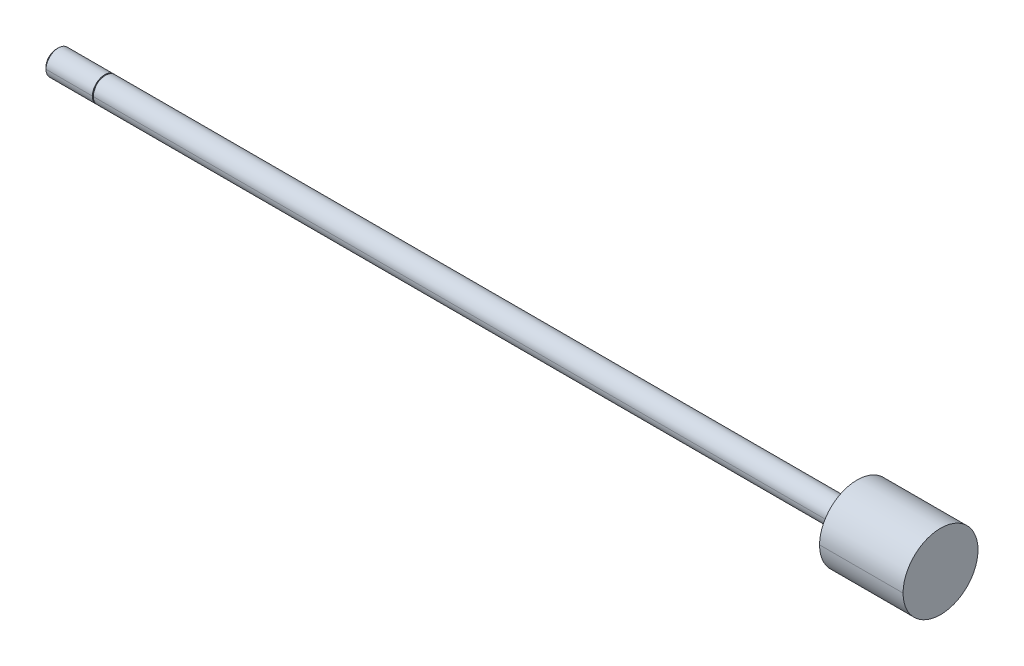
ISO-10303-21;
HEADER;
FILE_DESCRIPTION(('STEP AP214'),'2;1');
FILE_NAME('part.step','',(''),(''),'','','');
FILE_SCHEMA(('AUTOMOTIVE_DESIGN { 1 0 10303 214 1 1 1 1 }'));
ENDSEC;
DATA;
#1=APPLICATION_CONTEXT('core data for automotive mechanical design processes');
#2=APPLICATION_PROTOCOL_DEFINITION('international standard','automotive_design',2000,#1);
#3=PRODUCT_CONTEXT('',#1,'mechanical');
#4=PRODUCT('Part','Part','',(#3));
#5=PRODUCT_RELATED_PRODUCT_CATEGORY('part','',(#4));
#6=PRODUCT_DEFINITION_FORMATION('','',#4);
#7=PRODUCT_DEFINITION_CONTEXT('part definition',#1,'design');
#8=PRODUCT_DEFINITION('design','',#6,#7);
#9=PRODUCT_DEFINITION_SHAPE('','',#8);
#10=(LENGTH_UNIT() NAMED_UNIT(*) SI_UNIT(.MILLI.,.METRE.));
#11=(NAMED_UNIT(*) PLANE_ANGLE_UNIT() SI_UNIT($,.RADIAN.));
#12=(NAMED_UNIT(*) SI_UNIT($,.STERADIAN.) SOLID_ANGLE_UNIT());
#13=UNCERTAINTY_MEASURE_WITH_UNIT(LENGTH_MEASURE(1.E-05),#10,'distance_accuracy_value','');
#14=(GEOMETRIC_REPRESENTATION_CONTEXT(3) GLOBAL_UNCERTAINTY_ASSIGNED_CONTEXT((#13)) GLOBAL_UNIT_ASSIGNED_CONTEXT((#10,
#11,#12)) REPRESENTATION_CONTEXT('',''));
#15=CARTESIAN_POINT('',(0.,0.,0.));
#16=DIRECTION('',(0.,0.,1.));
#17=DIRECTION('',(1.,0.,0.));
#18=AXIS2_PLACEMENT_3D('',#15,#16,#17);
#19=CARTESIAN_POINT('',(0.,0.,0.));
#20=DIRECTION('',(-1.,0.,0.));
#21=DIRECTION('',(0.,-1.,0.));
#22=AXIS2_PLACEMENT_3D('',#19,#20,#21);
#23=CYLINDRICAL_SURFACE('',#22,2.921);
#24=CARTESIAN_POINT('',(0.,0.,0.));
#25=DIRECTION('',(1.,0.,0.));
#26=DIRECTION('',(0.,0.,-1.));
#27=AXIS2_PLACEMENT_3D('',#24,#25,#26);
#28=CIRCLE('',#27,2.921);
#29=CARTESIAN_POINT('',(0.,0.,-2.921));
#30=VERTEX_POINT('',#29);
#31=CARTESIAN_POINT('',(0.,0.,2.921));
#32=VERTEX_POINT('',#31);
#33=EDGE_CURVE('E11',#30,#32,#28,.T.);
#34=ORIENTED_EDGE('',*,*,#33,.F.);
#35=DIRECTION('',(-1.,0.,0.));
#36=VECTOR('',#35,1.);
#37=CARTESIAN_POINT('',(0.,0.,-2.921));
#38=LINE('',#37,#36);
#39=CARTESIAN_POINT('',(-0.254,0.,-2.921));
#40=VERTEX_POINT('',#39);
#41=EDGE_CURVE('E25',#30,#40,#38,.T.);
#42=ORIENTED_EDGE('',*,*,#41,.T.);
#43=CARTESIAN_POINT('',(-0.254,0.,0.));
#44=DIRECTION('',(1.,0.,0.));
#45=DIRECTION('',(0.,0.,-1.));
#46=AXIS2_PLACEMENT_3D('',#43,#44,#45);
#47=CIRCLE('',#46,2.921);
#48=CARTESIAN_POINT('',(-0.254,0.,2.921));
#49=VERTEX_POINT('',#48);
#50=EDGE_CURVE('E211',#40,#49,#47,.T.);
#51=ORIENTED_EDGE('',*,*,#50,.T.);
#52=DIRECTION('',(-1.,0.,0.));
#53=VECTOR('',#52,1.);
#54=CARTESIAN_POINT('',(0.,0.,2.921));
#55=LINE('',#54,#53);
#56=EDGE_CURVE('E206',#32,#49,#55,.T.);
#57=ORIENTED_EDGE('',*,*,#56,.F.);
#58=EDGE_LOOP('',(#34,#42,#51,#57));
#59=FACE_BOUND('',#58,.T.);
#60=ADVANCED_FACE('F17',(#59),#23,.T.);
#61=CARTESIAN_POINT('',(0.,0.,0.));
#62=DIRECTION('',(-1.,0.,0.));
#63=DIRECTION('',(0.,1.,0.));
#64=AXIS2_PLACEMENT_3D('',#61,#62,#63);
#65=CYLINDRICAL_SURFACE('',#64,2.921);
#66=CARTESIAN_POINT('',(-0.254,0.,0.));
#67=DIRECTION('',(1.,0.,0.));
#68=DIRECTION('',(0.,0.,-1.));
#69=AXIS2_PLACEMENT_3D('',#66,#67,#68);
#70=CIRCLE('',#69,2.921);
#71=EDGE_CURVE('E202',#49,#40,#70,.T.);
#72=ORIENTED_EDGE('',*,*,#71,.T.);
#73=ORIENTED_EDGE('',*,*,#41,.F.);
#74=CARTESIAN_POINT('',(0.,0.,0.));
#75=DIRECTION('',(1.,0.,0.));
#76=DIRECTION('',(0.,0.,-1.));
#77=AXIS2_PLACEMENT_3D('',#74,#75,#76);
#78=CIRCLE('',#77,2.921);
#79=EDGE_CURVE('E197',#32,#30,#78,.T.);
#80=ORIENTED_EDGE('',*,*,#79,.F.);
#81=ORIENTED_EDGE('',*,*,#56,.T.);
#82=EDGE_LOOP('',(#72,#73,#80,#81));
#83=FACE_BOUND('',#82,.T.);
#84=ADVANCED_FACE('F224',(#83),#65,.T.);
#85=CARTESIAN_POINT('',(0.,2.921,0.));
#86=DIRECTION('',(1.,0.,0.));
#87=DIRECTION('',(0.,0.,-1.));
#88=AXIS2_PLACEMENT_3D('',#85,#86,#87);
#89=PLANE('',#88);
#90=CARTESIAN_POINT('',(0.,0.,0.));
#91=DIRECTION('',(1.,0.,0.));
#92=DIRECTION('',(0.,0.,-1.));
#93=AXIS2_PLACEMENT_3D('',#90,#91,#92);
#94=CIRCLE('',#93,3.175);
#95=CARTESIAN_POINT('',(0.,0.,-3.175));
#96=VERTEX_POINT('',#95);
#97=CARTESIAN_POINT('',(0.,0.,3.175));
#98=VERTEX_POINT('',#97);
#99=EDGE_CURVE('E192',#96,#98,#94,.T.);
#100=ORIENTED_EDGE('',*,*,#99,.F.);
#101=CARTESIAN_POINT('',(0.,0.,0.));
#102=DIRECTION('',(1.,0.,0.));
#103=DIRECTION('',(0.,0.,-1.));
#104=AXIS2_PLACEMENT_3D('',#101,#102,#103);
#105=CIRCLE('',#104,3.175);
#106=EDGE_CURVE('E187',#98,#96,#105,.T.);
#107=ORIENTED_EDGE('',*,*,#106,.F.);
#108=EDGE_LOOP('',(#100,#107));
#109=FACE_BOUND('',#108,.T.);
#110=ORIENTED_EDGE('',*,*,#33,.T.);
#111=ORIENTED_EDGE('',*,*,#79,.T.);
#112=EDGE_LOOP('',(#110,#111));
#113=FACE_BOUND('',#112,.T.);
#114=ADVANCED_FACE('F249',(#109,#113),#89,.F.);
#115=CARTESIAN_POINT('',(214.3252,0.,0.));
#116=DIRECTION('',(-1.,0.,0.));
#117=DIRECTION('',(0.,1.,0.));
#118=AXIS2_PLACEMENT_3D('',#115,#116,#117);
#119=CYLINDRICAL_SURFACE('',#118,3.175);
#120=ORIENTED_EDGE('',*,*,#106,.T.);
#121=DIRECTION('',(-1.,0.,0.));
#122=VECTOR('',#121,1.);
#123=CARTESIAN_POINT('',(192.8876,0.,-3.175));
#124=LINE('',#123,#122);
#125=CARTESIAN_POINT('',(192.8876,0.,-3.175));
#126=VERTEX_POINT('',#125);
#127=EDGE_CURVE('E182',#126,#96,#124,.T.);
#128=ORIENTED_EDGE('',*,*,#127,.F.);
#129=CARTESIAN_POINT('',(192.8876,0.,0.));
#130=DIRECTION('',(1.,0.,0.));
#131=DIRECTION('',(0.,0.,-1.));
#132=AXIS2_PLACEMENT_3D('',#129,#130,#131);
#133=CIRCLE('',#132,3.175);
#134=CARTESIAN_POINT('',(192.8876,0.,3.175));
#135=VERTEX_POINT('',#134);
#136=EDGE_CURVE('E177',#135,#126,#133,.T.);
#137=ORIENTED_EDGE('',*,*,#136,.F.);
#138=DIRECTION('',(-1.,0.,0.));
#139=VECTOR('',#138,1.);
#140=CARTESIAN_POINT('',(192.8876,0.,3.175));
#141=LINE('',#140,#139);
#142=EDGE_CURVE('E172',#135,#98,#141,.T.);
#143=ORIENTED_EDGE('',*,*,#142,.T.);
#144=EDGE_LOOP('',(#120,#128,#137,#143));
#145=FACE_BOUND('',#144,.T.);
#146=ADVANCED_FACE('F253',(#145),#119,.T.);
#147=CARTESIAN_POINT('',(214.3252,0.,0.));
#148=DIRECTION('',(-1.,0.,0.));
#149=DIRECTION('',(0.,-1.,0.));
#150=AXIS2_PLACEMENT_3D('',#147,#148,#149);
#151=CYLINDRICAL_SURFACE('',#150,3.175);
#152=CARTESIAN_POINT('',(192.8876,0.,0.));
#153=DIRECTION('',(1.,0.,0.));
#154=DIRECTION('',(0.,0.,-1.));
#155=AXIS2_PLACEMENT_3D('',#152,#153,#154);
#156=CIRCLE('',#155,3.175);
#157=EDGE_CURVE('E167',#126,#135,#156,.T.);
#158=ORIENTED_EDGE('',*,*,#157,.F.);
#159=ORIENTED_EDGE('',*,*,#127,.T.);
#160=ORIENTED_EDGE('',*,*,#99,.T.);
#161=ORIENTED_EDGE('',*,*,#142,.F.);
#162=EDGE_LOOP('',(#158,#159,#160,#161));
#163=FACE_BOUND('',#162,.T.);
#164=ADVANCED_FACE('F259',(#163),#151,.T.);
#165=CARTESIAN_POINT('',(192.8876,3.175,0.));
#166=DIRECTION('',(1.,0.,0.));
#167=DIRECTION('',(0.,0.,-1.));
#168=AXIS2_PLACEMENT_3D('',#165,#166,#167);
#169=PLANE('',#168);
#170=CARTESIAN_POINT('',(192.8876,0.,0.));
#171=DIRECTION('',(1.,0.,0.));
#172=DIRECTION('',(0.,0.,-1.));
#173=AXIS2_PLACEMENT_3D('',#170,#171,#172);
#174=CIRCLE('',#173,9.62025);
#175=CARTESIAN_POINT('',(192.8876,0.,-9.62025));
#176=VERTEX_POINT('',#175);
#177=CARTESIAN_POINT('',(192.8876,0.,9.62025));
#178=VERTEX_POINT('',#177);
#179=EDGE_CURVE('E162',#176,#178,#174,.T.);
#180=ORIENTED_EDGE('',*,*,#179,.F.);
#181=CARTESIAN_POINT('',(192.8876,0.,0.));
#182=DIRECTION('',(1.,0.,0.));
#183=DIRECTION('',(0.,0.,-1.));
#184=AXIS2_PLACEMENT_3D('',#181,#182,#183);
#185=CIRCLE('',#184,9.62025);
#186=EDGE_CURVE('E157',#178,#176,#185,.T.);
#187=ORIENTED_EDGE('',*,*,#186,.F.);
#188=EDGE_LOOP('',(#180,#187));
#189=FACE_BOUND('',#188,.T.);
#190=ORIENTED_EDGE('',*,*,#157,.T.);
#191=ORIENTED_EDGE('',*,*,#136,.T.);
#192=EDGE_LOOP('',(#190,#191));
#193=FACE_BOUND('',#192,.T.);
#194=ADVANCED_FACE('F263',(#189,#193),#169,.F.);
#195=CARTESIAN_POINT('',(214.3252,0.,0.));
#196=DIRECTION('',(-1.,0.,0.));
#197=DIRECTION('',(0.,1.,0.));
#198=AXIS2_PLACEMENT_3D('',#195,#196,#197);
#199=CYLINDRICAL_SURFACE('',#198,9.62025);
#200=ORIENTED_EDGE('',*,*,#186,.T.);
#201=DIRECTION('',(-1.,0.,0.));
#202=VECTOR('',#201,1.);
#203=CARTESIAN_POINT('',(214.3252,0.,-9.62025));
#204=LINE('',#203,#202);
#205=CARTESIAN_POINT('',(214.3252,0.,-9.62025));
#206=VERTEX_POINT('',#205);
#207=EDGE_CURVE('E152',#206,#176,#204,.T.);
#208=ORIENTED_EDGE('',*,*,#207,.F.);
#209=CARTESIAN_POINT('',(214.3252,0.,0.));
#210=DIRECTION('',(1.,0.,0.));
#211=DIRECTION('',(0.,0.,-1.));
#212=AXIS2_PLACEMENT_3D('',#209,#210,#211);
#213=CIRCLE('',#212,9.62025);
#214=CARTESIAN_POINT('',(214.3252,0.,9.62025));
#215=VERTEX_POINT('',#214);
#216=EDGE_CURVE('E147',#215,#206,#213,.T.);
#217=ORIENTED_EDGE('',*,*,#216,.F.);
#218=DIRECTION('',(-1.,0.,0.));
#219=VECTOR('',#218,1.);
#220=CARTESIAN_POINT('',(214.3252,0.,9.62025));
#221=LINE('',#220,#219);
#222=EDGE_CURVE('E142',#215,#178,#221,.T.);
#223=ORIENTED_EDGE('',*,*,#222,.T.);
#224=EDGE_LOOP('',(#200,#208,#217,#223));
#225=FACE_BOUND('',#224,.T.);
#226=ADVANCED_FACE('F267',(#225),#199,.T.);
#227=CARTESIAN_POINT('',(214.3252,0.,0.));
#228=DIRECTION('',(-1.,0.,0.));
#229=DIRECTION('',(0.,-1.,0.));
#230=AXIS2_PLACEMENT_3D('',#227,#228,#229);
#231=CYLINDRICAL_SURFACE('',#230,9.62025);
#232=CARTESIAN_POINT('',(214.3252,0.,0.));
#233=DIRECTION('',(1.,0.,0.));
#234=DIRECTION('',(0.,0.,-1.));
#235=AXIS2_PLACEMENT_3D('',#232,#233,#234);
#236=CIRCLE('',#235,9.62025);
#237=EDGE_CURVE('E137',#206,#215,#236,.T.);
#238=ORIENTED_EDGE('',*,*,#237,.F.);
#239=ORIENTED_EDGE('',*,*,#207,.T.);
#240=ORIENTED_EDGE('',*,*,#179,.T.);
#241=ORIENTED_EDGE('',*,*,#222,.F.);
#242=EDGE_LOOP('',(#238,#239,#240,#241));
#243=FACE_BOUND('',#242,.T.);
#244=ADVANCED_FACE('F271',(#243),#231,.T.);
#245=CARTESIAN_POINT('',(214.3252,9.62025,0.));
#246=DIRECTION('',(-1.,0.,0.));
#247=DIRECTION('',(0.,0.,1.));
#248=AXIS2_PLACEMENT_3D('',#245,#246,#247);
#249=PLANE('',#248);
#250=ORIENTED_EDGE('',*,*,#237,.T.);
#251=ORIENTED_EDGE('',*,*,#216,.T.);
#252=EDGE_LOOP('',(#250,#251));
#253=FACE_BOUND('',#252,.T.);
#254=ADVANCED_FACE('F229',(#253),#249,.F.);
#255=CARTESIAN_POINT('',(-0.254,3.429,0.));
#256=DIRECTION('',(-1.,0.,0.));
#257=DIRECTION('',(0.,0.,1.));
#258=AXIS2_PLACEMENT_3D('',#255,#256,#257);
#259=PLANE('',#258);
#260=ORIENTED_EDGE('',*,*,#50,.F.);
#261=ORIENTED_EDGE('',*,*,#71,.F.);
#262=EDGE_LOOP('',(#260,#261));
#263=FACE_BOUND('',#262,.T.);
#264=CARTESIAN_POINT('',(-0.254000000000005,0.,0.));
#265=DIRECTION('',(-1.,0.,0.));
#266=DIRECTION('',(0.,0.,1.));
#267=AXIS2_PLACEMENT_3D('',#264,#265,#266);
#268=CIRCLE('',#267,3.175);
#269=CARTESIAN_POINT('',(-0.254000000000005,0.,3.175));
#270=VERTEX_POINT('',#269);
#271=CARTESIAN_POINT('',(-0.254000000000019,0.,-3.175));
#272=VERTEX_POINT('',#271);
#273=EDGE_CURVE('E132',#270,#272,#268,.T.);
#274=ORIENTED_EDGE('',*,*,#273,.F.);
#275=CARTESIAN_POINT('',(-0.254000000000005,0.,0.));
#276=DIRECTION('',(-1.,0.,0.));
#277=DIRECTION('',(0.,0.,1.));
#278=AXIS2_PLACEMENT_3D('',#275,#276,#277);
#279=CIRCLE('',#278,3.175);
#280=EDGE_CURVE('E127',#272,#270,#279,.T.);
#281=ORIENTED_EDGE('',*,*,#280,.F.);
#282=EDGE_LOOP('',(#274,#281));
#283=FACE_BOUND('',#282,.T.);
#284=ADVANCED_FACE('F225',(#263,#283),#259,.F.);
#285=CARTESIAN_POINT('',(214.3252,0.,0.));
#286=DIRECTION('',(-1.,0.,0.));
#287=DIRECTION('',(0.,1.,0.));
#288=AXIS2_PLACEMENT_3D('',#285,#286,#287);
#289=CYLINDRICAL_SURFACE('',#288,3.175);
#290=CARTESIAN_POINT('',(-12.15898,0.,0.));
#291=DIRECTION('',(1.,0.,0.));
#292=DIRECTION('',(0.,0.,-1.));
#293=AXIS2_PLACEMENT_3D('',#290,#291,#292);
#294=CIRCLE('',#293,3.175);
#295=CARTESIAN_POINT('',(-12.15898,0.,3.175));
#296=VERTEX_POINT('',#295);
#297=CARTESIAN_POINT('',(-12.15898,0.,-3.175));
#298=VERTEX_POINT('',#297);
#299=EDGE_CURVE('E98',#296,#298,#294,.T.);
#300=ORIENTED_EDGE('',*,*,#299,.T.);
#301=DIRECTION('',(-1.,0.,0.));
#302=VECTOR('',#301,1.);
#303=CARTESIAN_POINT('',(-0.254000000000019,0.,-3.175));
#304=LINE('',#303,#302);
#305=EDGE_CURVE('E119',#272,#298,#304,.T.);
#306=ORIENTED_EDGE('',*,*,#305,.F.);
#307=ORIENTED_EDGE('',*,*,#280,.T.);
#308=DIRECTION('',(-1.,0.,0.));
#309=VECTOR('',#308,1.);
#310=CARTESIAN_POINT('',(-0.254000000000019,0.,3.175));
#311=LINE('',#310,#309);
#312=EDGE_CURVE('E115',#270,#296,#311,.T.);
#313=ORIENTED_EDGE('',*,*,#312,.T.);
#314=EDGE_LOOP('',(#300,#306,#307,#313));
#315=FACE_BOUND('',#314,.T.);
#316=ADVANCED_FACE('F228',(#315),#289,.T.);
#317=CARTESIAN_POINT('',(214.3252,0.,0.));
#318=DIRECTION('',(-1.,0.,0.));
#319=DIRECTION('',(0.,-1.,0.));
#320=AXIS2_PLACEMENT_3D('',#317,#318,#319);
#321=CYLINDRICAL_SURFACE('',#320,3.175);
#322=ORIENTED_EDGE('',*,*,#273,.T.);
#323=ORIENTED_EDGE('',*,*,#305,.T.);
#324=CARTESIAN_POINT('',(-12.15898,0.,0.));
#325=DIRECTION('',(1.,0.,0.));
#326=DIRECTION('',(0.,0.,-1.));
#327=AXIS2_PLACEMENT_3D('',#324,#325,#326);
#328=CIRCLE('',#327,3.175);
#329=EDGE_CURVE('E110',#298,#296,#328,.T.);
#330=ORIENTED_EDGE('',*,*,#329,.T.);
#331=ORIENTED_EDGE('',*,*,#312,.F.);
#332=EDGE_LOOP('',(#322,#323,#330,#331));
#333=FACE_BOUND('',#332,.T.);
#334=ADVANCED_FACE('F235',(#333),#321,.T.);
#335=CARTESIAN_POINT('',(-12.7,0.,0.));
#336=DIRECTION('',(1.,0.,0.));
#337=DIRECTION('',(0.,-1.,0.));
#338=AXIS2_PLACEMENT_3D('',#335,#336,#337);
#339=CONICAL_SURFACE('',#338,2.63398,0.7853981634);
#340=ORIENTED_EDGE('',*,*,#329,.F.);
#341=DIRECTION('',(0.707106781184742,0.,-0.707106781188353));
#342=VECTOR('',#341,1.);
#343=CARTESIAN_POINT('',(-12.7,0.,-2.63398));
#344=LINE('',#343,#342);
#345=CARTESIAN_POINT('',(-12.7,0.,-2.63398));
#346=VERTEX_POINT('',#345);
#347=EDGE_CURVE('E90',#346,#298,#344,.T.);
#348=ORIENTED_EDGE('',*,*,#347,.F.);
#349=CARTESIAN_POINT('',(-12.7,0.,0.));
#350=DIRECTION('',(1.,0.,0.));
#351=DIRECTION('',(0.,0.,-1.));
#352=AXIS2_PLACEMENT_3D('',#349,#350,#351);
#353=CIRCLE('',#352,2.63398);
#354=CARTESIAN_POINT('',(-12.7,0.,2.63398));
#355=VERTEX_POINT('',#354);
#356=EDGE_CURVE('E83',#346,#355,#353,.T.);
#357=ORIENTED_EDGE('',*,*,#356,.T.);
#358=DIRECTION('',(0.707106781184742,0.,0.707106781188353));
#359=VECTOR('',#358,1.);
#360=CARTESIAN_POINT('',(-12.7,0.,2.63398));
#361=LINE('',#360,#359);
#362=EDGE_CURVE('E87',#355,#296,#361,.T.);
#363=ORIENTED_EDGE('',*,*,#362,.T.);
#364=EDGE_LOOP('',(#340,#348,#357,#363));
#365=FACE_BOUND('',#364,.T.);
#366=ADVANCED_FACE('F86',(#365),#339,.T.);
#367=CARTESIAN_POINT('',(-12.7,0.,0.));
#368=DIRECTION('',(1.,0.,0.));
#369=DIRECTION('',(0.,1.,0.));
#370=AXIS2_PLACEMENT_3D('',#367,#368,#369);
#371=CONICAL_SURFACE('',#370,2.63398,0.7853981634);
#372=CARTESIAN_POINT('',(-12.7,0.,0.));
#373=DIRECTION('',(1.,0.,0.));
#374=DIRECTION('',(0.,0.,-1.));
#375=AXIS2_PLACEMENT_3D('',#372,#373,#374);
#376=CIRCLE('',#375,2.63398);
#377=EDGE_CURVE('E97',#355,#346,#376,.T.);
#378=ORIENTED_EDGE('',*,*,#377,.T.);
#379=ORIENTED_EDGE('',*,*,#347,.T.);
#380=ORIENTED_EDGE('',*,*,#299,.F.);
#381=ORIENTED_EDGE('',*,*,#362,.F.);
#382=EDGE_LOOP('',(#378,#379,#380,#381));
#383=FACE_BOUND('',#382,.T.);
#384=ADVANCED_FACE('F96',(#383),#371,.T.);
#385=CARTESIAN_POINT('',(-12.7,0.,0.));
#386=DIRECTION('',(1.,0.,0.));
#387=DIRECTION('',(0.,0.,-1.));
#388=AXIS2_PLACEMENT_3D('',#385,#386,#387);
#389=PLANE('',#388);
#390=ORIENTED_EDGE('',*,*,#356,.F.);
#391=ORIENTED_EDGE('',*,*,#377,.F.);
#392=EDGE_LOOP('',(#390,#391));
#393=FACE_BOUND('',#392,.T.);
#394=ADVANCED_FACE('F100',(#393),#389,.F.);
#395=CLOSED_SHELL('',(#60,#84,#114,#146,#164,#194,#226,#244,#254,#284,#316,#334,#366,#384,#394));
#396=MANIFOLD_SOLID_BREP('B1',#395);
#397=ADVANCED_BREP_SHAPE_REPRESENTATION('',(#18,#396),#14);
#398=SHAPE_DEFINITION_REPRESENTATION(#9,#397);
ENDSEC;
END-ISO-10303-21;
